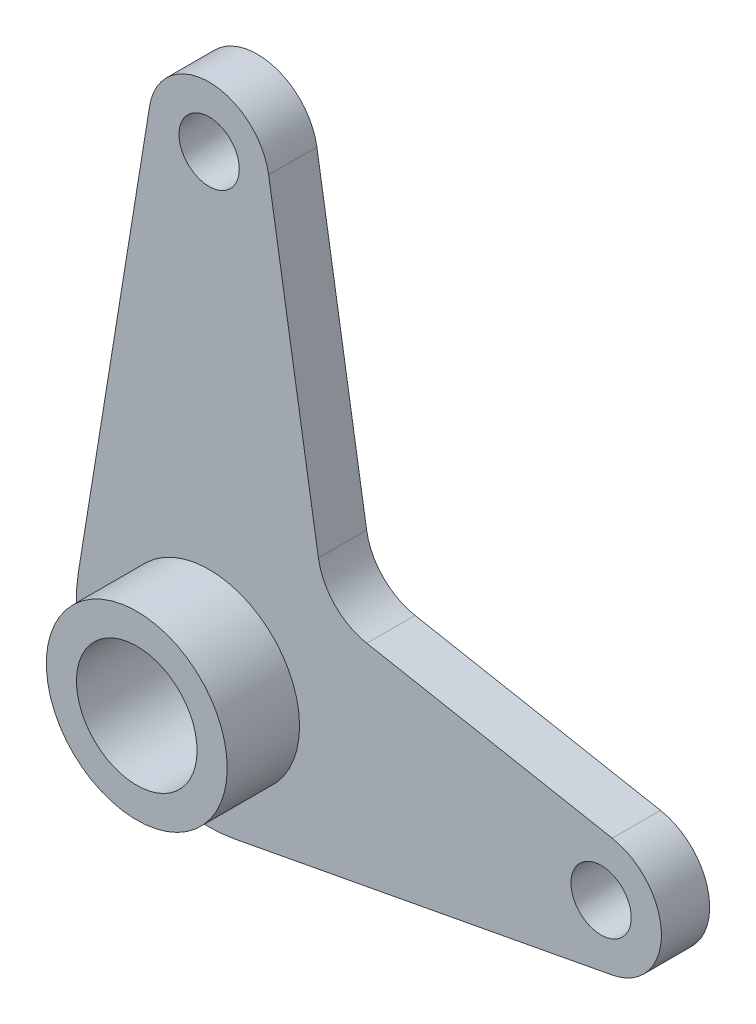
ISO-10303-21;
HEADER;
FILE_DESCRIPTION(('STEP AP214'),'2;1');
FILE_NAME('part.step','',(''),(''),'','','');
FILE_SCHEMA(('AUTOMOTIVE_DESIGN { 1 0 10303 214 1 1 1 1 }'));
ENDSEC;
DATA;
#1=APPLICATION_CONTEXT('core data for automotive mechanical design processes');
#2=APPLICATION_PROTOCOL_DEFINITION('international standard','automotive_design',2000,#1);
#3=PRODUCT_CONTEXT('',#1,'mechanical');
#4=PRODUCT('Part','Part','',(#3));
#5=PRODUCT_RELATED_PRODUCT_CATEGORY('part','',(#4));
#6=PRODUCT_DEFINITION_FORMATION('','',#4);
#7=PRODUCT_DEFINITION_CONTEXT('part definition',#1,'design');
#8=PRODUCT_DEFINITION('design','',#6,#7);
#9=PRODUCT_DEFINITION_SHAPE('','',#8);
#10=(LENGTH_UNIT() NAMED_UNIT(*) SI_UNIT(.MILLI.,.METRE.));
#11=(NAMED_UNIT(*) PLANE_ANGLE_UNIT() SI_UNIT($,.RADIAN.));
#12=(NAMED_UNIT(*) SI_UNIT($,.STERADIAN.) SOLID_ANGLE_UNIT());
#13=UNCERTAINTY_MEASURE_WITH_UNIT(LENGTH_MEASURE(1.E-05),#10,'distance_accuracy_value','');
#14=(GEOMETRIC_REPRESENTATION_CONTEXT(3) GLOBAL_UNCERTAINTY_ASSIGNED_CONTEXT((#13)) GLOBAL_UNIT_ASSIGNED_CONTEXT((#10,
#11,#12)) REPRESENTATION_CONTEXT('',''));
#15=CARTESIAN_POINT('',(0.,0.,0.));
#16=DIRECTION('',(0.,0.,1.));
#17=DIRECTION('',(1.,0.,0.));
#18=AXIS2_PLACEMENT_3D('',#15,#16,#17);
#19=CARTESIAN_POINT('',(0.,75.,8.));
#20=DIRECTION('',(0.,0.,1.));
#21=DIRECTION('',(1.,0.,0.));
#22=AXIS2_PLACEMENT_3D('',#19,#20,#21);
#23=PLANE('',#22);
#24=CARTESIAN_POINT('',(0.,0.,8.));
#25=DIRECTION('',(0.,0.,1.));
#26=DIRECTION('',(1.,0.,0.));
#27=AXIS2_PLACEMENT_3D('',#24,#25,#26);
#28=CIRCLE('',#27,15.);
#29=CARTESIAN_POINT('',(15.,0.,8.));
#30=VERTEX_POINT('',#29);
#31=EDGE_CURVE('E194',#30,#30,#28,.T.);
#32=ORIENTED_EDGE('',*,*,#31,.F.);
#33=EDGE_LOOP('',(#32));
#34=FACE_BOUND('',#33,.T.);
#35=CARTESIAN_POINT('',(0.,75.,8.));
#36=DIRECTION('',(0.,0.,1.));
#37=DIRECTION('',(1.,0.,0.));
#38=AXIS2_PLACEMENT_3D('',#35,#36,#37);
#39=CIRCLE('',#38,5.);
#40=CARTESIAN_POINT('',(5.,75.,8.));
#41=VERTEX_POINT('',#40);
#42=EDGE_CURVE('E137',#41,#41,#39,.T.);
#43=ORIENTED_EDGE('',*,*,#42,.F.);
#44=EDGE_LOOP('',(#43));
#45=FACE_BOUND('',#44,.T.);
#46=CARTESIAN_POINT('',(0.,75.,8.));
#47=DIRECTION('',(0.,0.,1.));
#48=DIRECTION('',(1.,0.,0.));
#49=AXIS2_PLACEMENT_3D('',#46,#47,#48);
#50=CIRCLE('',#49,10.);
#51=CARTESIAN_POINT('',(9.87117014340245,76.6,8.));
#52=VERTEX_POINT('',#51);
#53=CARTESIAN_POINT('',(-9.87117014340245,76.6,8.));
#54=VERTEX_POINT('',#53);
#55=EDGE_CURVE('E148',#52,#54,#50,.T.);
#56=ORIENTED_EDGE('',*,*,#55,.T.);
#57=DIRECTION('',(-0.16,-0.987117014340245,0.));
#58=VECTOR('',#57,1.);
#59=CARTESIAN_POINT('',(-9.87117014340245,76.6,8.));
#60=LINE('',#59,#58);
#61=CARTESIAN_POINT('',(-21.7165743154854,3.52,8.));
#62=VERTEX_POINT('',#61);
#63=EDGE_CURVE('E96',#54,#62,#60,.T.);
#64=ORIENTED_EDGE('',*,*,#63,.T.);
#65=CARTESIAN_POINT('',(0.,0.,8.));
#66=DIRECTION('',(0.,0.,1.));
#67=DIRECTION('',(1.,0.,0.));
#68=AXIS2_PLACEMENT_3D('',#65,#66,#67);
#69=CIRCLE('',#68,22.);
#70=CARTESIAN_POINT('',(4.06153846153845,-21.6218386203728,8.));
#71=VERTEX_POINT('',#70);
#72=EDGE_CURVE('E163',#62,#71,#69,.T.);
#73=ORIENTED_EDGE('',*,*,#72,.T.);
#74=DIRECTION('',(0.982810846380581,0.184615384615385,0.));
#75=VECTOR('',#74,1.);
#76=CARTESIAN_POINT('',(4.06153846153846,-21.6218386203728,8.));
#77=LINE('',#76,#75);
#78=CARTESIAN_POINT('',(66.8461538461539,-9.82810846380581,8.));
#79=VERTEX_POINT('',#78);
#80=EDGE_CURVE('E176',#71,#79,#77,.T.);
#81=ORIENTED_EDGE('',*,*,#80,.T.);
#82=CARTESIAN_POINT('',(65.,0.,8.));
#83=DIRECTION('',(0.,0.,1.));
#84=DIRECTION('',(1.,0.,0.));
#85=AXIS2_PLACEMENT_3D('',#82,#83,#84);
#86=CIRCLE('',#85,10.);
#87=CARTESIAN_POINT('',(66.8461538461539,9.82810846380581,8.));
#88=VERTEX_POINT('',#87);
#89=EDGE_CURVE('E115',#79,#88,#86,.T.);
#90=ORIENTED_EDGE('',*,*,#89,.T.);
#91=DIRECTION('',(-0.982810846380581,0.184615384615385,0.));
#92=VECTOR('',#91,1.);
#93=CARTESIAN_POINT('',(26.1462376659149,17.4733544509661,8.));
#94=LINE('',#93,#92);
#95=CARTESIAN_POINT('',(26.1462376659149,17.4733544509661,8.));
#96=VERTEX_POINT('',#95);
#97=EDGE_CURVE('E109',#88,#96,#94,.T.);
#98=ORIENTED_EDGE('',*,*,#97,.T.);
#99=CARTESIAN_POINT('',(27.9923915120687,27.3014629147719,8.));
#100=DIRECTION('',(0.,0.,-1.));
#101=DIRECTION('',(-1.,0.,0.));
#102=AXIS2_PLACEMENT_3D('',#99,#100,#101);
#103=CIRCLE('',#102,10.);
#104=CARTESIAN_POINT('',(18.1212213686663,25.7014629147719,8.));
#105=VERTEX_POINT('',#104);
#106=EDGE_CURVE('E113',#96,#105,#103,.T.);
#107=ORIENTED_EDGE('',*,*,#106,.T.);
#108=DIRECTION('',(-0.16,0.987117014340245,0.));
#109=VECTOR('',#108,1.);
#110=CARTESIAN_POINT('',(9.87117014340245,76.6,8.));
#111=LINE('',#110,#109);
#112=EDGE_CURVE('E53',#105,#52,#111,.T.);
#113=ORIENTED_EDGE('',*,*,#112,.T.);
#114=EDGE_LOOP('',(#56,#64,#73,#81,#90,#98,#107,#113));
#115=FACE_BOUND('',#114,.T.);
#116=CARTESIAN_POINT('',(65.,0.,8.));
#117=DIRECTION('',(0.,0.,1.));
#118=DIRECTION('',(1.,0.,0.));
#119=AXIS2_PLACEMENT_3D('',#116,#117,#118);
#120=CIRCLE('',#119,5.);
#121=CARTESIAN_POINT('',(70.,0.,8.));
#122=VERTEX_POINT('',#121);
#123=EDGE_CURVE('E185',#122,#122,#120,.T.);
#124=ORIENTED_EDGE('',*,*,#123,.F.);
#125=EDGE_LOOP('',(#124));
#126=FACE_BOUND('',#125,.T.);
#127=ADVANCED_FACE('F36',(#34,#45,#115,#126),#23,.T.);
#128=CARTESIAN_POINT('',(0.,75.,0.));
#129=DIRECTION('',(0.,0.,1.));
#130=DIRECTION('',(1.,0.,0.));
#131=AXIS2_PLACEMENT_3D('',#128,#129,#130);
#132=PLANE('',#131);
#133=CARTESIAN_POINT('',(0.,0.,0.));
#134=DIRECTION('',(0.,0.,1.));
#135=DIRECTION('',(1.,0.,0.));
#136=AXIS2_PLACEMENT_3D('',#133,#134,#135);
#137=CIRCLE('',#136,10.);
#138=CARTESIAN_POINT('',(10.,0.,0.));
#139=VERTEX_POINT('',#138);
#140=EDGE_CURVE('E197',#139,#139,#137,.T.);
#141=ORIENTED_EDGE('',*,*,#140,.T.);
#142=EDGE_LOOP('',(#141));
#143=FACE_BOUND('',#142,.T.);
#144=CARTESIAN_POINT('',(0.,75.,0.));
#145=DIRECTION('',(0.,0.,1.));
#146=DIRECTION('',(1.,0.,0.));
#147=AXIS2_PLACEMENT_3D('',#144,#145,#146);
#148=CIRCLE('',#147,10.);
#149=CARTESIAN_POINT('',(9.87117014340245,76.6,0.));
#150=VERTEX_POINT('',#149);
#151=CARTESIAN_POINT('',(-9.87117014340245,76.6,0.));
#152=VERTEX_POINT('',#151);
#153=EDGE_CURVE('E133',#150,#152,#148,.T.);
#154=ORIENTED_EDGE('',*,*,#153,.F.);
#155=DIRECTION('',(-0.16,0.987117014340245,0.));
#156=VECTOR('',#155,1.);
#157=CARTESIAN_POINT('',(9.87117014340245,76.6,0.));
#158=LINE('',#157,#156);
#159=CARTESIAN_POINT('',(18.1212213686663,25.7014629147719,0.));
#160=VERTEX_POINT('',#159);
#161=EDGE_CURVE('E88',#160,#150,#158,.T.);
#162=ORIENTED_EDGE('',*,*,#161,.F.);
#163=CARTESIAN_POINT('',(27.9923915120687,27.3014629147719,0.));
#164=DIRECTION('',(0.,0.,-1.));
#165=DIRECTION('',(-1.,0.,0.));
#166=AXIS2_PLACEMENT_3D('',#163,#164,#165);
#167=CIRCLE('',#166,10.);
#168=CARTESIAN_POINT('',(26.1462376659149,17.4733544509661,0.));
#169=VERTEX_POINT('',#168);
#170=EDGE_CURVE('E82',#169,#160,#167,.T.);
#171=ORIENTED_EDGE('',*,*,#170,.F.);
#172=DIRECTION('',(-0.982810846380581,0.184615384615385,0.));
#173=VECTOR('',#172,1.);
#174=CARTESIAN_POINT('',(26.1462376659149,17.4733544509661,0.));
#175=LINE('',#174,#173);
#176=CARTESIAN_POINT('',(66.8461538461539,9.82810846380581,0.));
#177=VERTEX_POINT('',#176);
#178=EDGE_CURVE('E123',#177,#169,#175,.T.);
#179=ORIENTED_EDGE('',*,*,#178,.F.);
#180=CARTESIAN_POINT('',(65.,0.,0.));
#181=DIRECTION('',(0.,0.,1.));
#182=DIRECTION('',(1.,0.,0.));
#183=AXIS2_PLACEMENT_3D('',#180,#181,#182);
#184=CIRCLE('',#183,10.);
#185=CARTESIAN_POINT('',(66.8461538461539,-9.82810846380581,0.));
#186=VERTEX_POINT('',#185);
#187=EDGE_CURVE('E143',#186,#177,#184,.T.);
#188=ORIENTED_EDGE('',*,*,#187,.F.);
#189=DIRECTION('',(0.982810846380581,0.184615384615385,0.));
#190=VECTOR('',#189,1.);
#191=CARTESIAN_POINT('',(4.06153846153846,-21.6218386203728,0.));
#192=LINE('',#191,#190);
#193=CARTESIAN_POINT('',(4.06153846153845,-21.6218386203728,0.));
#194=VERTEX_POINT('',#193);
#195=EDGE_CURVE('E141',#194,#186,#192,.T.);
#196=ORIENTED_EDGE('',*,*,#195,.F.);
#197=CARTESIAN_POINT('',(0.,0.,0.));
#198=DIRECTION('',(0.,0.,1.));
#199=DIRECTION('',(1.,0.,0.));
#200=AXIS2_PLACEMENT_3D('',#197,#198,#199);
#201=CIRCLE('',#200,22.);
#202=CARTESIAN_POINT('',(-21.7165743154854,3.52,0.));
#203=VERTEX_POINT('',#202);
#204=EDGE_CURVE('E139',#203,#194,#201,.T.);
#205=ORIENTED_EDGE('',*,*,#204,.F.);
#206=DIRECTION('',(-0.16,-0.987117014340245,0.));
#207=VECTOR('',#206,1.);
#208=CARTESIAN_POINT('',(-9.87117014340245,76.6,0.));
#209=LINE('',#208,#207);
#210=EDGE_CURVE('E136',#152,#203,#209,.T.);
#211=ORIENTED_EDGE('',*,*,#210,.F.);
#212=EDGE_LOOP('',(#154,#162,#171,#179,#188,#196,#205,#211));
#213=FACE_BOUND('',#212,.T.);
#214=CARTESIAN_POINT('',(0.,75.,0.));
#215=DIRECTION('',(0.,0.,1.));
#216=DIRECTION('',(1.,0.,0.));
#217=AXIS2_PLACEMENT_3D('',#214,#215,#216);
#218=CIRCLE('',#217,5.);
#219=CARTESIAN_POINT('',(5.,75.,0.));
#220=VERTEX_POINT('',#219);
#221=EDGE_CURVE('E182',#220,#220,#218,.T.);
#222=ORIENTED_EDGE('',*,*,#221,.T.);
#223=EDGE_LOOP('',(#222));
#224=FACE_BOUND('',#223,.T.);
#225=CARTESIAN_POINT('',(65.,0.,0.));
#226=DIRECTION('',(0.,0.,1.));
#227=DIRECTION('',(1.,0.,0.));
#228=AXIS2_PLACEMENT_3D('',#225,#226,#227);
#229=CIRCLE('',#228,5.);
#230=CARTESIAN_POINT('',(70.,0.,0.));
#231=VERTEX_POINT('',#230);
#232=EDGE_CURVE('E188',#231,#231,#229,.T.);
#233=ORIENTED_EDGE('',*,*,#232,.T.);
#234=EDGE_LOOP('',(#233));
#235=FACE_BOUND('',#234,.T.);
#236=ADVANCED_FACE('F167',(#143,#213,#224,#235),#132,.F.);
#237=CARTESIAN_POINT('',(0.,75.,8.));
#238=DIRECTION('',(0.,0.,-1.));
#239=DIRECTION('',(-1.,0.,0.));
#240=AXIS2_PLACEMENT_3D('',#237,#238,#239);
#241=CYLINDRICAL_SURFACE('',#240,10.);
#242=ORIENTED_EDGE('',*,*,#153,.T.);
#243=DIRECTION('',(0.,0.,-1.));
#244=VECTOR('',#243,1.);
#245=CARTESIAN_POINT('',(-9.87117014340245,76.6,8.));
#246=LINE('',#245,#244);
#247=EDGE_CURVE('E11',#54,#152,#246,.T.);
#248=ORIENTED_EDGE('',*,*,#247,.F.);
#249=ORIENTED_EDGE('',*,*,#55,.F.);
#250=DIRECTION('',(0.,0.,-1.));
#251=VECTOR('',#250,1.);
#252=CARTESIAN_POINT('',(9.87117014340245,76.6,8.));
#253=LINE('',#252,#251);
#254=EDGE_CURVE('E129',#52,#150,#253,.T.);
#255=ORIENTED_EDGE('',*,*,#254,.T.);
#256=EDGE_LOOP('',(#242,#248,#249,#255));
#257=FACE_BOUND('',#256,.T.);
#258=ADVANCED_FACE('F38',(#257),#241,.T.);
#259=CARTESIAN_POINT('',(-9.87117014340245,76.6,8.));
#260=DIRECTION('',(0.987117014340245,-0.16,0.));
#261=DIRECTION('',(0.16,0.987117014340245,0.));
#262=AXIS2_PLACEMENT_3D('',#259,#260,#261);
#263=PLANE('',#262);
#264=ORIENTED_EDGE('',*,*,#210,.T.);
#265=DIRECTION('',(0.,0.,-1.));
#266=VECTOR('',#265,1.);
#267=CARTESIAN_POINT('',(-21.7165743154854,3.52,8.));
#268=LINE('',#267,#266);
#269=EDGE_CURVE('E45',#62,#203,#268,.T.);
#270=ORIENTED_EDGE('',*,*,#269,.F.);
#271=ORIENTED_EDGE('',*,*,#63,.F.);
#272=ORIENTED_EDGE('',*,*,#247,.T.);
#273=EDGE_LOOP('',(#264,#270,#271,#272));
#274=FACE_BOUND('',#273,.T.);
#275=ADVANCED_FACE('F259',(#274),#263,.F.);
#276=CARTESIAN_POINT('',(0.,0.,8.));
#277=DIRECTION('',(0.,0.,-1.));
#278=DIRECTION('',(-1.,0.,0.));
#279=AXIS2_PLACEMENT_3D('',#276,#277,#278);
#280=CYLINDRICAL_SURFACE('',#279,22.);
#281=ORIENTED_EDGE('',*,*,#204,.T.);
#282=DIRECTION('',(0.,0.,-1.));
#283=VECTOR('',#282,1.);
#284=CARTESIAN_POINT('',(4.06153846153845,-21.6218386203728,8.));
#285=LINE('',#284,#283);
#286=EDGE_CURVE('E155',#71,#194,#285,.T.);
#287=ORIENTED_EDGE('',*,*,#286,.F.);
#288=ORIENTED_EDGE('',*,*,#72,.F.);
#289=ORIENTED_EDGE('',*,*,#269,.T.);
#290=EDGE_LOOP('',(#281,#287,#288,#289));
#291=FACE_BOUND('',#290,.T.);
#292=ADVANCED_FACE('F161',(#291),#280,.T.);
#293=CARTESIAN_POINT('',(4.06153846153846,-21.6218386203728,8.));
#294=DIRECTION('',(-0.184615384615385,0.982810846380581,0.));
#295=DIRECTION('',(-0.982810846380581,-0.184615384615385,0.));
#296=AXIS2_PLACEMENT_3D('',#293,#294,#295);
#297=PLANE('',#296);
#298=ORIENTED_EDGE('',*,*,#195,.T.);
#299=DIRECTION('',(0.,0.,-1.));
#300=VECTOR('',#299,1.);
#301=CARTESIAN_POINT('',(66.8461538461539,-9.82810846380581,8.));
#302=LINE('',#301,#300);
#303=EDGE_CURVE('E152',#79,#186,#302,.T.);
#304=ORIENTED_EDGE('',*,*,#303,.F.);
#305=ORIENTED_EDGE('',*,*,#80,.F.);
#306=ORIENTED_EDGE('',*,*,#286,.T.);
#307=EDGE_LOOP('',(#298,#304,#305,#306));
#308=FACE_BOUND('',#307,.T.);
#309=ADVANCED_FACE('F172',(#308),#297,.F.);
#310=CARTESIAN_POINT('',(65.,0.,8.));
#311=DIRECTION('',(0.,0.,-1.));
#312=DIRECTION('',(-1.,0.,0.));
#313=AXIS2_PLACEMENT_3D('',#310,#311,#312);
#314=CYLINDRICAL_SURFACE('',#313,10.);
#315=ORIENTED_EDGE('',*,*,#187,.T.);
#316=DIRECTION('',(0.,0.,-1.));
#317=VECTOR('',#316,1.);
#318=CARTESIAN_POINT('',(66.8461538461539,9.82810846380581,8.));
#319=LINE('',#318,#317);
#320=EDGE_CURVE('E124',#88,#177,#319,.T.);
#321=ORIENTED_EDGE('',*,*,#320,.F.);
#322=ORIENTED_EDGE('',*,*,#89,.F.);
#323=ORIENTED_EDGE('',*,*,#303,.T.);
#324=EDGE_LOOP('',(#315,#321,#322,#323));
#325=FACE_BOUND('',#324,.T.);
#326=ADVANCED_FACE('F175',(#325),#314,.T.);
#327=CARTESIAN_POINT('',(26.1462376659149,17.4733544509661,8.));
#328=DIRECTION('',(-0.184615384615385,-0.982810846380581,0.));
#329=DIRECTION('',(0.982810846380581,-0.184615384615385,0.));
#330=AXIS2_PLACEMENT_3D('',#327,#328,#329);
#331=PLANE('',#330);
#332=ORIENTED_EDGE('',*,*,#178,.T.);
#333=DIRECTION('',(0.,0.,-1.));
#334=VECTOR('',#333,1.);
#335=CARTESIAN_POINT('',(26.1462376659149,17.4733544509661,8.));
#336=LINE('',#335,#334);
#337=EDGE_CURVE('E120',#96,#169,#336,.T.);
#338=ORIENTED_EDGE('',*,*,#337,.F.);
#339=ORIENTED_EDGE('',*,*,#97,.F.);
#340=ORIENTED_EDGE('',*,*,#320,.T.);
#341=EDGE_LOOP('',(#332,#338,#339,#340));
#342=FACE_BOUND('',#341,.T.);
#343=ADVANCED_FACE('F121',(#342),#331,.F.);
#344=CARTESIAN_POINT('',(27.9923915120687,27.3014629147719,8.));
#345=DIRECTION('',(0.,0.,-1.));
#346=DIRECTION('',(-1.,0.,0.));
#347=AXIS2_PLACEMENT_3D('',#344,#345,#346);
#348=CYLINDRICAL_SURFACE('',#347,10.);
#349=ORIENTED_EDGE('',*,*,#170,.T.);
#350=DIRECTION('',(0.,0.,-1.));
#351=VECTOR('',#350,1.);
#352=CARTESIAN_POINT('',(18.1212213686663,25.7014629147719,8.));
#353=LINE('',#352,#351);
#354=EDGE_CURVE('E125',#105,#160,#353,.T.);
#355=ORIENTED_EDGE('',*,*,#354,.F.);
#356=ORIENTED_EDGE('',*,*,#106,.F.);
#357=ORIENTED_EDGE('',*,*,#337,.T.);
#358=EDGE_LOOP('',(#349,#355,#356,#357));
#359=FACE_BOUND('',#358,.T.);
#360=ADVANCED_FACE('F127',(#359),#348,.F.);
#361=CARTESIAN_POINT('',(9.87117014340245,76.6,8.));
#362=DIRECTION('',(-0.987117014340245,-0.16,0.));
#363=DIRECTION('',(0.16,-0.987117014340245,0.));
#364=AXIS2_PLACEMENT_3D('',#361,#362,#363);
#365=PLANE('',#364);
#366=ORIENTED_EDGE('',*,*,#161,.T.);
#367=ORIENTED_EDGE('',*,*,#254,.F.);
#368=ORIENTED_EDGE('',*,*,#112,.F.);
#369=ORIENTED_EDGE('',*,*,#354,.T.);
#370=EDGE_LOOP('',(#366,#367,#368,#369));
#371=FACE_BOUND('',#370,.T.);
#372=ADVANCED_FACE('F234',(#371),#365,.F.);
#373=CARTESIAN_POINT('',(0.,75.,8.));
#374=DIRECTION('',(0.,0.,-1.));
#375=DIRECTION('',(-1.,0.,0.));
#376=AXIS2_PLACEMENT_3D('',#373,#374,#375);
#377=CYLINDRICAL_SURFACE('',#376,5.);
#378=ORIENTED_EDGE('',*,*,#42,.T.);
#379=EDGE_LOOP('',(#378));
#380=FACE_BOUND('',#379,.T.);
#381=ORIENTED_EDGE('',*,*,#221,.F.);
#382=EDGE_LOOP('',(#381));
#383=FACE_BOUND('',#382,.T.);
#384=ADVANCED_FACE('F231',(#380,#383),#377,.F.);
#385=CARTESIAN_POINT('',(65.,0.,8.));
#386=DIRECTION('',(0.,0.,-1.));
#387=DIRECTION('',(-1.,0.,0.));
#388=AXIS2_PLACEMENT_3D('',#385,#386,#387);
#389=CYLINDRICAL_SURFACE('',#388,5.);
#390=ORIENTED_EDGE('',*,*,#123,.T.);
#391=EDGE_LOOP('',(#390));
#392=FACE_BOUND('',#391,.T.);
#393=ORIENTED_EDGE('',*,*,#232,.F.);
#394=EDGE_LOOP('',(#393));
#395=FACE_BOUND('',#394,.T.);
#396=ADVANCED_FACE('F222',(#392,#395),#389,.F.);
#397=CARTESIAN_POINT('',(0.,0.,20.));
#398=DIRECTION('',(0.,0.,-1.));
#399=DIRECTION('',(-1.,0.,0.));
#400=AXIS2_PLACEMENT_3D('',#397,#398,#399);
#401=CYLINDRICAL_SURFACE('',#400,15.);
#402=CARTESIAN_POINT('',(0.,0.,20.));
#403=DIRECTION('',(0.,0.,1.));
#404=DIRECTION('',(1.,0.,0.));
#405=AXIS2_PLACEMENT_3D('',#402,#403,#404);
#406=CIRCLE('',#405,15.);
#407=CARTESIAN_POINT('',(15.,0.,20.));
#408=VERTEX_POINT('',#407);
#409=EDGE_CURVE('E191',#408,#408,#406,.T.);
#410=ORIENTED_EDGE('',*,*,#409,.F.);
#411=EDGE_LOOP('',(#410));
#412=FACE_BOUND('',#411,.T.);
#413=ORIENTED_EDGE('',*,*,#31,.T.);
#414=EDGE_LOOP('',(#413));
#415=FACE_BOUND('',#414,.T.);
#416=ADVANCED_FACE('F216',(#412,#415),#401,.T.);
#417=CARTESIAN_POINT('',(0.,0.,20.));
#418=DIRECTION('',(0.,0.,1.));
#419=DIRECTION('',(1.,0.,0.));
#420=AXIS2_PLACEMENT_3D('',#417,#418,#419);
#421=PLANE('',#420);
#422=CARTESIAN_POINT('',(0.,0.,20.));
#423=DIRECTION('',(0.,0.,1.));
#424=DIRECTION('',(1.,0.,0.));
#425=AXIS2_PLACEMENT_3D('',#422,#423,#424);
#426=CIRCLE('',#425,10.);
#427=CARTESIAN_POINT('',(10.,0.,20.));
#428=VERTEX_POINT('',#427);
#429=EDGE_CURVE('E200',#428,#428,#426,.T.);
#430=ORIENTED_EDGE('',*,*,#429,.F.);
#431=EDGE_LOOP('',(#430));
#432=FACE_BOUND('',#431,.T.);
#433=ORIENTED_EDGE('',*,*,#409,.T.);
#434=EDGE_LOOP('',(#433));
#435=FACE_BOUND('',#434,.T.);
#436=ADVANCED_FACE('F210',(#432,#435),#421,.T.);
#437=CARTESIAN_POINT('',(0.,0.,0.));
#438=DIRECTION('',(0.,0.,1.));
#439=DIRECTION('',(1.,0.,0.));
#440=AXIS2_PLACEMENT_3D('',#437,#438,#439);
#441=CYLINDRICAL_SURFACE('',#440,10.);
#442=ORIENTED_EDGE('',*,*,#140,.F.);
#443=EDGE_LOOP('',(#442));
#444=FACE_BOUND('',#443,.T.);
#445=ORIENTED_EDGE('',*,*,#429,.T.);
#446=EDGE_LOOP('',(#445));
#447=FACE_BOUND('',#446,.T.);
#448=ADVANCED_FACE('F207',(#444,#447),#441,.F.);
#449=CLOSED_SHELL('',(#127,#236,#258,#275,#292,#309,#326,#343,#360,#372,#384,#396,#416,#436,#448));
#450=MANIFOLD_SOLID_BREP('B2',#449);
#451=ADVANCED_BREP_SHAPE_REPRESENTATION('',(#18,#450),#14);
#452=SHAPE_DEFINITION_REPRESENTATION(#9,#451);
ENDSEC;
END-ISO-10303-21;
